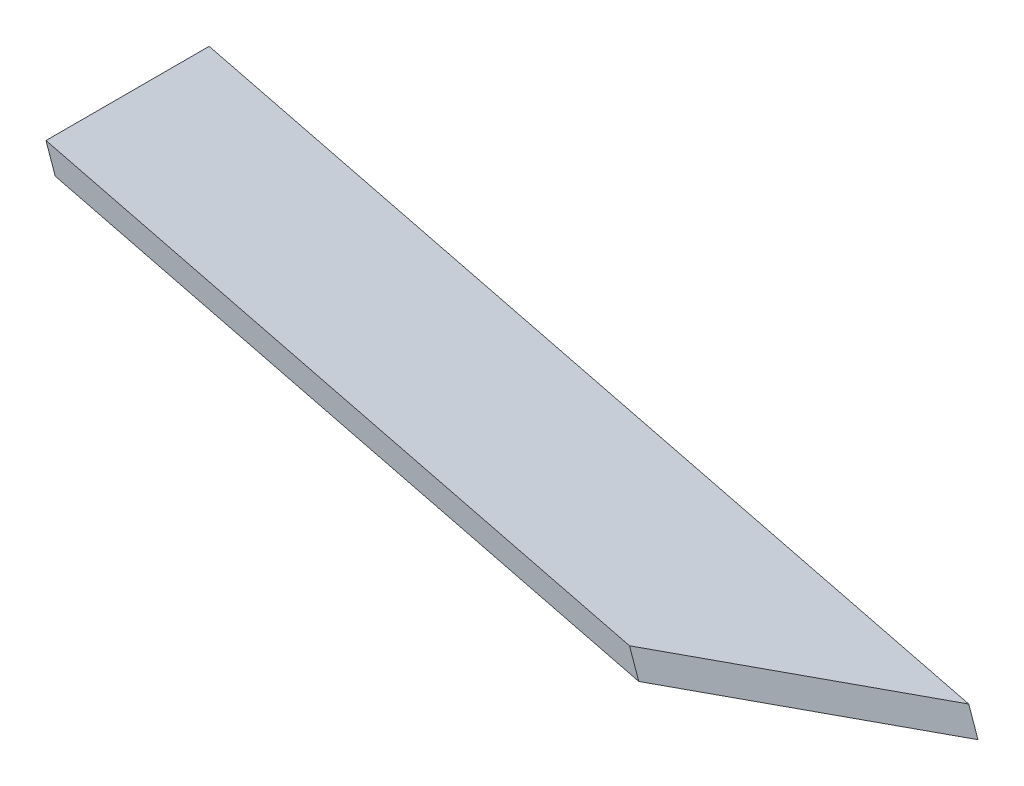
ISO-10303-21;
HEADER;
FILE_DESCRIPTION(('STEP AP214'),'2;1');
FILE_NAME('part.step','',(''),(''),'','','');
FILE_SCHEMA(('AUTOMOTIVE_DESIGN { 1 0 10303 214 1 1 1 1 }'));
ENDSEC;
DATA;
#1=APPLICATION_CONTEXT('core data for automotive mechanical design processes');
#2=APPLICATION_PROTOCOL_DEFINITION('international standard','automotive_design',2000,#1);
#3=PRODUCT_CONTEXT('',#1,'mechanical');
#4=PRODUCT('Part','Part','',(#3));
#5=PRODUCT_RELATED_PRODUCT_CATEGORY('part','',(#4));
#6=PRODUCT_DEFINITION_FORMATION('','',#4);
#7=PRODUCT_DEFINITION_CONTEXT('part definition',#1,'design');
#8=PRODUCT_DEFINITION('design','',#6,#7);
#9=PRODUCT_DEFINITION_SHAPE('','',#8);
#10=(LENGTH_UNIT() NAMED_UNIT(*) SI_UNIT(.MILLI.,.METRE.));
#11=(NAMED_UNIT(*) PLANE_ANGLE_UNIT() SI_UNIT($,.RADIAN.));
#12=(NAMED_UNIT(*) SI_UNIT($,.STERADIAN.) SOLID_ANGLE_UNIT());
#13=UNCERTAINTY_MEASURE_WITH_UNIT(LENGTH_MEASURE(1.E-05),#10,'distance_accuracy_value','');
#14=(GEOMETRIC_REPRESENTATION_CONTEXT(3) GLOBAL_UNCERTAINTY_ASSIGNED_CONTEXT((#13)) GLOBAL_UNIT_ASSIGNED_CONTEXT((#10,
#11,#12)) REPRESENTATION_CONTEXT('',''));
#15=CARTESIAN_POINT('',(0.,0.,0.));
#16=DIRECTION('',(0.,0.,1.));
#17=DIRECTION('',(1.,0.,0.));
#18=AXIS2_PLACEMENT_3D('',#15,#16,#17);
#19=CARTESIAN_POINT('',(106.809151666894,314.04250929092,12.8496010807307));
#20=DIRECTION('',(-0.389885604163817,-0.136968633863503,0.910620013509137));
#21=DIRECTION('',(-0.859146227065338,-0.301822082563161,-0.413244710790854));
#22=AXIS2_PLACEMENT_3D('',#19,#20,#21);
#23=PLANE('',#22);
#24=DIRECTION('',(-0.331446792389363,0.943473912630764,0.));
#25=VECTOR('',#24,1.);
#26=CARTESIAN_POINT('',(-649.999999999997,48.1719193225501,-351.171527281475));
#27=LINE('',#26,#25);
#28=CARTESIAN_POINT('',(-645.028298114158,34.0198106330905,-351.171527281475));
#29=VERTEX_POINT('',#28);
#30=CARTESIAN_POINT('',(-649.999999999997,48.1719193225501,-351.171527281475));
#31=VERTEX_POINT('',#30);
#32=EDGE_CURVE('E11',#29,#31,#27,.T.);
#33=ORIENTED_EDGE('',*,*,#32,.F.);
#34=DIRECTION('',(-0.859146227065338,-0.301822082563161,-0.413244710790854));
#35=VECTOR('',#34,1.);
#36=CARTESIAN_POINT('',(111.780853552735,299.890400601458,12.8496010807306));
#37=LINE('',#36,#35);
#38=CARTESIAN_POINT('',(-39.6753134044783,246.683141711193,-59.9999999999998));
#39=VERTEX_POINT('',#38);
#40=EDGE_CURVE('E91',#39,#29,#37,.T.);
#41=ORIENTED_EDGE('',*,*,#40,.F.);
#42=DIRECTION('',(-0.331446792389363,0.943473912630764,0.));
#43=VECTOR('',#42,1.);
#44=CARTESIAN_POINT('',(-44.6470152903187,260.835250400655,-59.9999999999997));
#45=LINE('',#44,#43);
#46=CARTESIAN_POINT('',(-44.6470152903187,260.835250400655,-59.9999999999997));
#47=VERTEX_POINT('',#46);
#48=EDGE_CURVE('E47',#39,#47,#45,.T.);
#49=ORIENTED_EDGE('',*,*,#48,.T.);
#50=DIRECTION('',(-0.859146227065338,-0.301822082563161,-0.413244710790854));
#51=VECTOR('',#50,1.);
#52=CARTESIAN_POINT('',(106.809151666894,314.04250929092,12.8496010807307));
#53=LINE('',#52,#51);
#54=EDGE_CURVE('E104',#47,#31,#53,.T.);
#55=ORIENTED_EDGE('',*,*,#54,.T.);
#56=EDGE_LOOP('',(#33,#41,#49,#55));
#57=FACE_BOUND('',#56,.T.);
#58=ADVANCED_FACE('F37',(#57),#23,.T.);
#59=CARTESIAN_POINT('',(138.000000000001,325.,-60.0000000000007));
#60=DIRECTION('',(0.,0.,1.));
#61=DIRECTION('',(-0.943473912630764,-0.331446792389363,0.));
#62=AXIS2_PLACEMENT_3D('',#59,#60,#61);
#63=PLANE('',#62);
#64=ORIENTED_EDGE('',*,*,#48,.F.);
#65=DIRECTION('',(-0.943473912630764,-0.331446792389363,0.));
#66=VECTOR('',#65,1.);
#67=CARTESIAN_POINT('',(142.971701885842,310.847891310539,-60.0000000000008));
#68=LINE('',#67,#66);
#69=CARTESIAN_POINT('',(142.971701885841,310.847891310538,-60.0000000000008));
#70=VERTEX_POINT('',#69);
#71=EDGE_CURVE('E98',#70,#39,#68,.T.);
#72=ORIENTED_EDGE('',*,*,#71,.F.);
#73=DIRECTION('',(-0.331446792389363,0.943473912630764,0.));
#74=VECTOR('',#73,1.);
#75=CARTESIAN_POINT('',(138.000000000001,325.,-60.0000000000007));
#76=LINE('',#75,#74);
#77=CARTESIAN_POINT('',(138.000000000001,325.,-60.0000000000007));
#78=VERTEX_POINT('',#77);
#79=EDGE_CURVE('E55',#70,#78,#76,.T.);
#80=ORIENTED_EDGE('',*,*,#79,.T.);
#81=DIRECTION('',(-0.943473912630764,-0.331446792389363,0.));
#82=VECTOR('',#81,1.);
#83=CARTESIAN_POINT('',(138.000000000001,325.,-60.0000000000007));
#84=LINE('',#83,#82);
#85=EDGE_CURVE('E85',#78,#47,#84,.T.);
#86=ORIENTED_EDGE('',*,*,#85,.T.);
#87=EDGE_LOOP('',(#64,#72,#80,#86));
#88=FACE_BOUND('',#87,.T.);
#89=ADVANCED_FACE('F108',(#88),#63,.T.);
#90=CARTESIAN_POINT('',(138.000000000001,325.,-60.0000000000006));
#91=DIRECTION('',(-0.389885604163817,-0.136968633863503,0.910620013509137));
#92=DIRECTION('',(-0.859146227065338,-0.301822082563161,-0.413244710790854));
#93=AXIS2_PLACEMENT_3D('',#90,#91,#92);
#94=PLANE('',#93);
#95=ORIENTED_EDGE('',*,*,#79,.F.);
#96=DIRECTION('',(-0.859146227065338,-0.301822082563161,-0.413244710790854));
#97=VECTOR('',#96,1.);
#98=CARTESIAN_POINT('',(142.971701885842,310.847891310539,-60.0000000000007));
#99=LINE('',#98,#97);
#100=CARTESIAN_POINT('',(-645.028298114158,34.0198106330909,-439.023758523039));
#101=VERTEX_POINT('',#100);
#102=EDGE_CURVE('E90',#70,#101,#99,.T.);
#103=ORIENTED_EDGE('',*,*,#102,.T.);
#104=DIRECTION('',(-0.331446792389363,0.943473912630764,0.));
#105=VECTOR('',#104,1.);
#106=CARTESIAN_POINT('',(-649.999999999997,48.1719193225501,-439.023758523038));
#107=LINE('',#106,#105);
#108=CARTESIAN_POINT('',(-649.999999999997,48.1719193225501,-439.023758523038));
#109=VERTEX_POINT('',#108);
#110=EDGE_CURVE('E41',#101,#109,#107,.T.);
#111=ORIENTED_EDGE('',*,*,#110,.T.);
#112=DIRECTION('',(-0.859146227065338,-0.301822082563161,-0.413244710790854));
#113=VECTOR('',#112,1.);
#114=CARTESIAN_POINT('',(138.000000000001,325.,-60.0000000000006));
#115=LINE('',#114,#113);
#116=EDGE_CURVE('E100',#78,#109,#115,.T.);
#117=ORIENTED_EDGE('',*,*,#116,.F.);
#118=EDGE_LOOP('',(#95,#103,#111,#117));
#119=FACE_BOUND('',#118,.T.);
#120=ADVANCED_FACE('F93',(#119),#94,.F.);
#121=CARTESIAN_POINT('',(-650.,48.17191932255,8.64270643027021E-12));
#122=DIRECTION('',(-0.943473912630764,-0.331446792389363,0.));
#123=DIRECTION('',(0.,0.,-1.));
#124=AXIS2_PLACEMENT_3D('',#121,#122,#123);
#125=PLANE('',#124);
#126=DIRECTION('',(0.,0.,-1.));
#127=VECTOR('',#126,1.);
#128=CARTESIAN_POINT('',(-645.028298114154,34.0198106330904,-59.9999999999919));
#129=LINE('',#128,#127);
#130=EDGE_CURVE('E79',#29,#101,#129,.T.);
#131=ORIENTED_EDGE('',*,*,#130,.F.);
#132=ORIENTED_EDGE('',*,*,#32,.T.);
#133=DIRECTION('',(0.,0.,-1.));
#134=VECTOR('',#133,1.);
#135=CARTESIAN_POINT('',(-650.,48.17191932255,8.64270643027021E-12));
#136=LINE('',#135,#134);
#137=EDGE_CURVE('E81',#31,#109,#136,.T.);
#138=ORIENTED_EDGE('',*,*,#137,.T.);
#139=ORIENTED_EDGE('',*,*,#110,.F.);
#140=EDGE_LOOP('',(#131,#132,#138,#139));
#141=FACE_BOUND('',#140,.T.);
#142=ADVANCED_FACE('F39',(#141),#125,.T.);
#143=CARTESIAN_POINT('',(138.000000000001,325.,-60.0000000000006));
#144=DIRECTION('',(0.331446792389363,-0.943473912630764,0.));
#145=DIRECTION('',(-0.943473912630764,-0.331446792389363,0.));
#146=AXIS2_PLACEMENT_3D('',#143,#144,#145);
#147=PLANE('',#146);
#148=ORIENTED_EDGE('',*,*,#116,.T.);
#149=ORIENTED_EDGE('',*,*,#137,.F.);
#150=ORIENTED_EDGE('',*,*,#54,.F.);
#151=ORIENTED_EDGE('',*,*,#85,.F.);
#152=EDGE_LOOP('',(#148,#149,#150,#151));
#153=FACE_BOUND('',#152,.T.);
#154=ADVANCED_FACE('F107',(#153),#147,.F.);
#155=CARTESIAN_POINT('',(142.971701885842,310.847891310539,-60.0000000000007));
#156=DIRECTION('',(0.331446792389363,-0.943473912630764,0.));
#157=DIRECTION('',(-0.943473912630764,-0.331446792389363,0.));
#158=AXIS2_PLACEMENT_3D('',#155,#156,#157);
#159=PLANE('',#158);
#160=ORIENTED_EDGE('',*,*,#102,.F.);
#161=ORIENTED_EDGE('',*,*,#71,.T.);
#162=ORIENTED_EDGE('',*,*,#40,.T.);
#163=ORIENTED_EDGE('',*,*,#130,.T.);
#164=EDGE_LOOP('',(#160,#161,#162,#163));
#165=FACE_BOUND('',#164,.T.);
#166=ADVANCED_FACE('F88',(#165),#159,.T.);
#167=CLOSED_SHELL('',(#58,#89,#120,#142,#154,#166));
#168=MANIFOLD_SOLID_BREP('B2',#167);
#169=ADVANCED_BREP_SHAPE_REPRESENTATION('',(#18,#168),#14);
#170=SHAPE_DEFINITION_REPRESENTATION(#9,#169);
ENDSEC;
END-ISO-10303-21;
